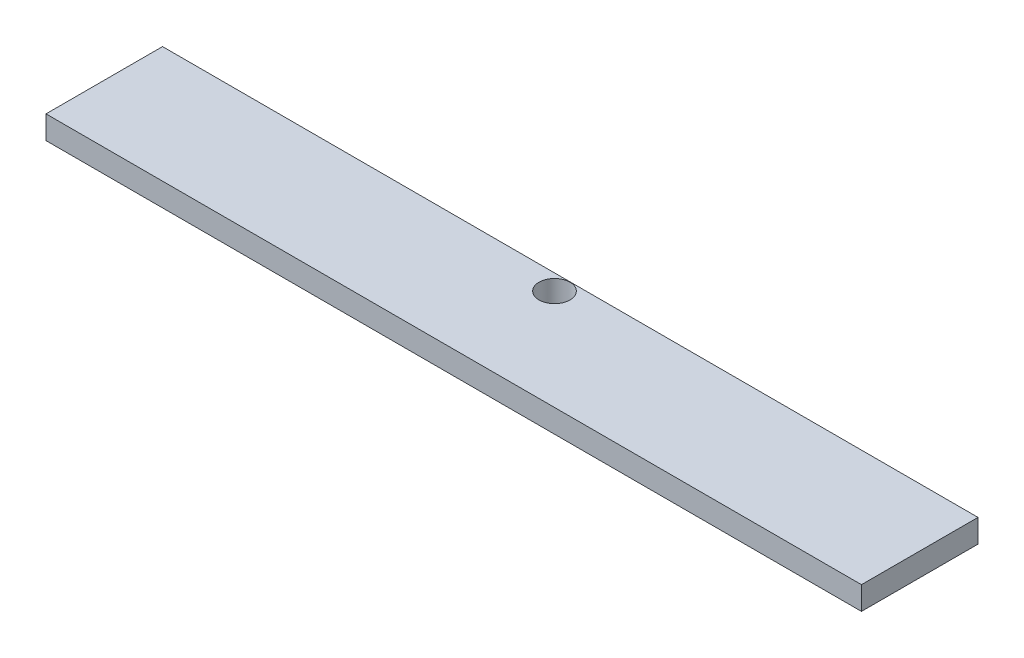
ISO-10303-21;
HEADER;
FILE_DESCRIPTION(('STEP AP214'),'2;1');
FILE_NAME('part.step','',(''),(''),'','','');
FILE_SCHEMA(('AUTOMOTIVE_DESIGN { 1 0 10303 214 1 1 1 1 }'));
ENDSEC;
DATA;
#1=APPLICATION_CONTEXT('core data for automotive mechanical design processes');
#2=APPLICATION_PROTOCOL_DEFINITION('international standard','automotive_design',2000,#1);
#3=PRODUCT_CONTEXT('',#1,'mechanical');
#4=PRODUCT('Part','Part','',(#3));
#5=PRODUCT_RELATED_PRODUCT_CATEGORY('part','',(#4));
#6=PRODUCT_DEFINITION_FORMATION('','',#4);
#7=PRODUCT_DEFINITION_CONTEXT('part definition',#1,'design');
#8=PRODUCT_DEFINITION('design','',#6,#7);
#9=PRODUCT_DEFINITION_SHAPE('','',#8);
#10=(LENGTH_UNIT() NAMED_UNIT(*) SI_UNIT(.MILLI.,.METRE.));
#11=(NAMED_UNIT(*) PLANE_ANGLE_UNIT() SI_UNIT($,.RADIAN.));
#12=(NAMED_UNIT(*) SI_UNIT($,.STERADIAN.) SOLID_ANGLE_UNIT());
#13=UNCERTAINTY_MEASURE_WITH_UNIT(LENGTH_MEASURE(1.E-05),#10,'distance_accuracy_value','');
#14=(GEOMETRIC_REPRESENTATION_CONTEXT(3) GLOBAL_UNCERTAINTY_ASSIGNED_CONTEXT((#13)) GLOBAL_UNIT_ASSIGNED_CONTEXT((#10,
#11,#12)) REPRESENTATION_CONTEXT('',''));
#15=CARTESIAN_POINT('',(0.,0.,0.));
#16=DIRECTION('',(0.,0.,1.));
#17=DIRECTION('',(1.,0.,0.));
#18=AXIS2_PLACEMENT_3D('',#15,#16,#17);
#19=CARTESIAN_POINT('',(0.,19.05,0.));
#20=DIRECTION('',(1.,0.,0.));
#21=DIRECTION('',(0.,0.,-1.));
#22=AXIS2_PLACEMENT_3D('',#19,#20,#21);
#23=PLANE('',#22);
#24=DIRECTION('',(0.,0.,1.));
#25=VECTOR('',#24,1.);
#26=CARTESIAN_POINT('',(0.,0.,0.));
#27=LINE('',#26,#25);
#28=CARTESIAN_POINT('',(0.,0.,-95.73895));
#29=VERTEX_POINT('',#28);
#30=CARTESIAN_POINT('',(0.,0.,0.));
#31=VERTEX_POINT('',#30);
#32=EDGE_CURVE('E101',#29,#31,#27,.T.);
#33=ORIENTED_EDGE('',*,*,#32,.T.);
#34=DIRECTION('',(0.,-1.,0.));
#35=VECTOR('',#34,1.);
#36=CARTESIAN_POINT('',(0.,19.05,0.));
#37=LINE('',#36,#35);
#38=CARTESIAN_POINT('',(0.,19.05,0.));
#39=VERTEX_POINT('',#38);
#40=EDGE_CURVE('E11',#39,#31,#37,.T.);
#41=ORIENTED_EDGE('',*,*,#40,.F.);
#42=DIRECTION('',(0.,0.,1.));
#43=VECTOR('',#42,1.);
#44=CARTESIAN_POINT('',(0.,19.05,0.));
#45=LINE('',#44,#43);
#46=CARTESIAN_POINT('',(0.,19.05,-95.73895));
#47=VERTEX_POINT('',#46);
#48=EDGE_CURVE('E89',#47,#39,#45,.T.);
#49=ORIENTED_EDGE('',*,*,#48,.F.);
#50=DIRECTION('',(0.,-1.,0.));
#51=VECTOR('',#50,1.);
#52=CARTESIAN_POINT('',(0.,19.05,-95.73895));
#53=LINE('',#52,#51);
#54=EDGE_CURVE('E97',#47,#29,#53,.T.);
#55=ORIENTED_EDGE('',*,*,#54,.T.);
#56=EDGE_LOOP('',(#33,#41,#49,#55));
#57=FACE_BOUND('',#56,.T.);
#58=ADVANCED_FACE('F38',(#57),#23,.F.);
#59=CARTESIAN_POINT('',(0.,19.05,0.));
#60=DIRECTION('',(0.,0.,-1.));
#61=DIRECTION('',(-1.,0.,0.));
#62=AXIS2_PLACEMENT_3D('',#59,#60,#61);
#63=PLANE('',#62);
#64=DIRECTION('',(1.,0.,0.));
#65=VECTOR('',#64,1.);
#66=CARTESIAN_POINT('',(0.,0.,0.));
#67=LINE('',#66,#65);
#68=CARTESIAN_POINT('',(669.925,0.,0.));
#69=VERTEX_POINT('',#68);
#70=EDGE_CURVE('E93',#31,#69,#67,.T.);
#71=ORIENTED_EDGE('',*,*,#70,.T.);
#72=DIRECTION('',(0.,-1.,0.));
#73=VECTOR('',#72,1.);
#74=CARTESIAN_POINT('',(669.925,19.05,0.));
#75=LINE('',#74,#73);
#76=CARTESIAN_POINT('',(669.925,19.05,0.));
#77=VERTEX_POINT('',#76);
#78=EDGE_CURVE('E46',#77,#69,#75,.T.);
#79=ORIENTED_EDGE('',*,*,#78,.F.);
#80=DIRECTION('',(1.,0.,0.));
#81=VECTOR('',#80,1.);
#82=CARTESIAN_POINT('',(0.,19.05,0.));
#83=LINE('',#82,#81);
#84=EDGE_CURVE('E84',#39,#77,#83,.T.);
#85=ORIENTED_EDGE('',*,*,#84,.F.);
#86=ORIENTED_EDGE('',*,*,#40,.T.);
#87=EDGE_LOOP('',(#71,#79,#85,#86));
#88=FACE_BOUND('',#87,.T.);
#89=ADVANCED_FACE('F92',(#88),#63,.F.);
#90=CARTESIAN_POINT('',(669.925,19.05,0.));
#91=DIRECTION('',(-1.,0.,0.));
#92=DIRECTION('',(0.,0.,1.));
#93=AXIS2_PLACEMENT_3D('',#90,#91,#92);
#94=PLANE('',#93);
#95=DIRECTION('',(0.,0.,-1.));
#96=VECTOR('',#95,1.);
#97=CARTESIAN_POINT('',(669.925,0.,0.));
#98=LINE('',#97,#96);
#99=CARTESIAN_POINT('',(669.925,0.,-95.73895));
#100=VERTEX_POINT('',#99);
#101=EDGE_CURVE('E71',#69,#100,#98,.T.);
#102=ORIENTED_EDGE('',*,*,#101,.T.);
#103=DIRECTION('',(0.,-1.,0.));
#104=VECTOR('',#103,1.);
#105=CARTESIAN_POINT('',(669.925,19.05,-95.73895));
#106=LINE('',#105,#104);
#107=CARTESIAN_POINT('',(669.925,19.05,-95.73895));
#108=VERTEX_POINT('',#107);
#109=EDGE_CURVE('E94',#108,#100,#106,.T.);
#110=ORIENTED_EDGE('',*,*,#109,.F.);
#111=DIRECTION('',(0.,0.,-1.));
#112=VECTOR('',#111,1.);
#113=CARTESIAN_POINT('',(669.925,19.05,0.));
#114=LINE('',#113,#112);
#115=EDGE_CURVE('E87',#77,#108,#114,.T.);
#116=ORIENTED_EDGE('',*,*,#115,.F.);
#117=ORIENTED_EDGE('',*,*,#78,.T.);
#118=EDGE_LOOP('',(#102,#110,#116,#117));
#119=FACE_BOUND('',#118,.T.);
#120=ADVANCED_FACE('F95',(#119),#94,.F.);
#121=CARTESIAN_POINT('',(0.,19.05,-95.73895));
#122=DIRECTION('',(0.,0.,1.));
#123=DIRECTION('',(1.,0.,0.));
#124=AXIS2_PLACEMENT_3D('',#121,#122,#123);
#125=PLANE('',#124);
#126=DIRECTION('',(-1.,0.,0.));
#127=VECTOR('',#126,1.);
#128=CARTESIAN_POINT('',(0.,0.,-95.73895));
#129=LINE('',#128,#127);
#130=EDGE_CURVE('E77',#100,#29,#129,.T.);
#131=ORIENTED_EDGE('',*,*,#130,.T.);
#132=ORIENTED_EDGE('',*,*,#54,.F.);
#133=DIRECTION('',(-1.,0.,0.));
#134=VECTOR('',#133,1.);
#135=CARTESIAN_POINT('',(0.,19.05,-95.73895));
#136=LINE('',#135,#134);
#137=EDGE_CURVE('E54',#108,#47,#136,.T.);
#138=ORIENTED_EDGE('',*,*,#137,.F.);
#139=ORIENTED_EDGE('',*,*,#109,.T.);
#140=EDGE_LOOP('',(#131,#132,#138,#139));
#141=FACE_BOUND('',#140,.T.);
#142=ADVANCED_FACE('F109',(#141),#125,.F.);
#143=CARTESIAN_POINT('',(0.,19.05,0.));
#144=DIRECTION('',(0.,-1.,0.));
#145=DIRECTION('',(0.,0.,-1.));
#146=AXIS2_PLACEMENT_3D('',#143,#144,#145);
#147=PLANE('',#146);
#148=CARTESIAN_POINT('',(334.9625,19.05,-82.78495));
#149=DIRECTION('',(0.,-1.,0.));
#150=DIRECTION('',(0.,0.,-1.));
#151=AXIS2_PLACEMENT_3D('',#148,#149,#150);
#152=CIRCLE('',#151,12.7);
#153=CARTESIAN_POINT('',(334.9625,19.05,-95.48495));
#154=VERTEX_POINT('',#153);
#155=EDGE_CURVE('E104',#154,#154,#152,.T.);
#156=ORIENTED_EDGE('',*,*,#155,.T.);
#157=EDGE_LOOP('',(#156));
#158=FACE_BOUND('',#157,.T.);
#159=ORIENTED_EDGE('',*,*,#48,.T.);
#160=ORIENTED_EDGE('',*,*,#84,.T.);
#161=ORIENTED_EDGE('',*,*,#115,.T.);
#162=ORIENTED_EDGE('',*,*,#137,.T.);
#163=EDGE_LOOP('',(#159,#160,#161,#162));
#164=FACE_BOUND('',#163,.T.);
#165=ADVANCED_FACE('F85',(#158,#164),#147,.F.);
#166=CARTESIAN_POINT('',(0.,0.,0.));
#167=DIRECTION('',(0.,-1.,0.));
#168=DIRECTION('',(0.,0.,-1.));
#169=AXIS2_PLACEMENT_3D('',#166,#167,#168);
#170=PLANE('',#169);
#171=CARTESIAN_POINT('',(334.9625,0.,-82.78495));
#172=DIRECTION('',(0.,-1.,0.));
#173=DIRECTION('',(0.,0.,-1.));
#174=AXIS2_PLACEMENT_3D('',#171,#172,#173);
#175=CIRCLE('',#174,12.7);
#176=CARTESIAN_POINT('',(334.9625,0.,-95.48495));
#177=VERTEX_POINT('',#176);
#178=EDGE_CURVE('E115',#177,#177,#175,.T.);
#179=ORIENTED_EDGE('',*,*,#178,.F.);
#180=EDGE_LOOP('',(#179));
#181=FACE_BOUND('',#180,.T.);
#182=ORIENTED_EDGE('',*,*,#32,.F.);
#183=ORIENTED_EDGE('',*,*,#130,.F.);
#184=ORIENTED_EDGE('',*,*,#101,.F.);
#185=ORIENTED_EDGE('',*,*,#70,.F.);
#186=EDGE_LOOP('',(#182,#183,#184,#185));
#187=FACE_BOUND('',#186,.T.);
#188=ADVANCED_FACE('F112',(#181,#187),#170,.T.);
#189=CARTESIAN_POINT('',(334.9625,19.05,-82.78495));
#190=DIRECTION('',(0.,-1.,0.));
#191=DIRECTION('',(0.,0.,-1.));
#192=AXIS2_PLACEMENT_3D('',#189,#190,#191);
#193=CYLINDRICAL_SURFACE('',#192,12.7);
#194=ORIENTED_EDGE('',*,*,#155,.F.);
#195=EDGE_LOOP('',(#194));
#196=FACE_BOUND('',#195,.T.);
#197=ORIENTED_EDGE('',*,*,#178,.T.);
#198=EDGE_LOOP('',(#197));
#199=FACE_BOUND('',#198,.T.);
#200=ADVANCED_FACE('F122',(#196,#199),#193,.F.);
#201=CLOSED_SHELL('',(#58,#89,#120,#142,#165,#188,#200));
#202=MANIFOLD_SOLID_BREP('B2',#201);
#203=ADVANCED_BREP_SHAPE_REPRESENTATION('',(#18,#202),#14);
#204=SHAPE_DEFINITION_REPRESENTATION(#9,#203);
ENDSEC;
END-ISO-10303-21;
